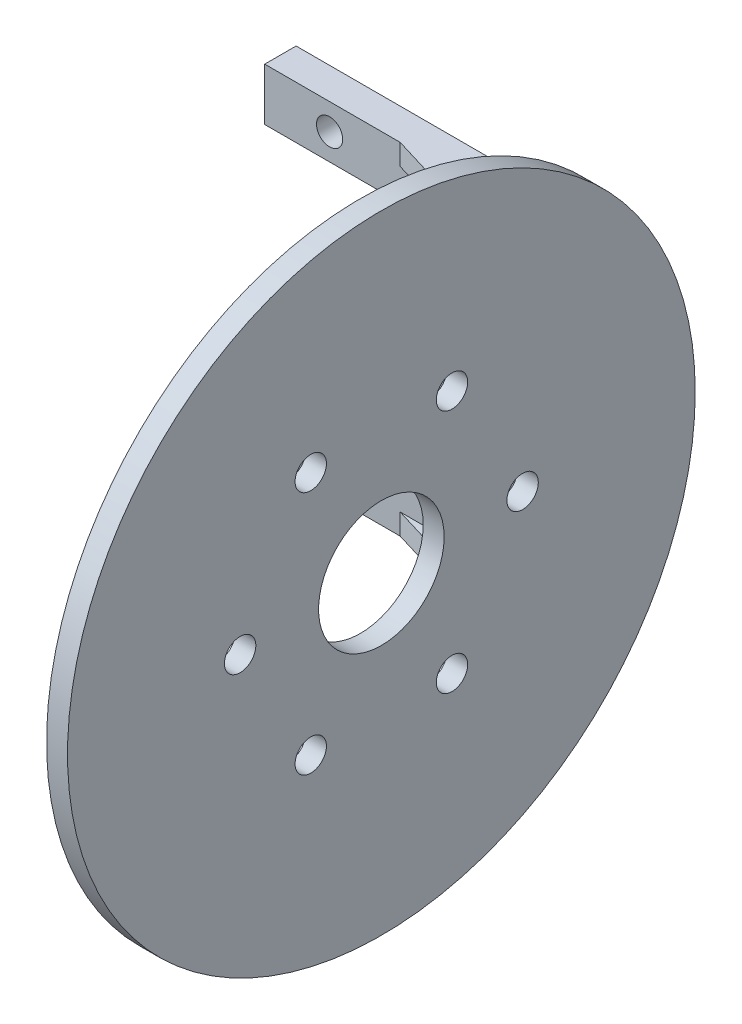
ISO-10303-21;
HEADER;
FILE_DESCRIPTION(('STEP AP214'),'2;1');
FILE_NAME('part.step','',(''),(''),'','','');
FILE_SCHEMA(('AUTOMOTIVE_DESIGN { 1 0 10303 214 1 1 1 1 }'));
ENDSEC;
DATA;
#1=APPLICATION_CONTEXT('core data for automotive mechanical design processes');
#2=APPLICATION_PROTOCOL_DEFINITION('international standard','automotive_design',2000,#1);
#3=PRODUCT_CONTEXT('',#1,'mechanical');
#4=PRODUCT('Part','Part','',(#3));
#5=PRODUCT_RELATED_PRODUCT_CATEGORY('part','',(#4));
#6=PRODUCT_DEFINITION_FORMATION('','',#4);
#7=PRODUCT_DEFINITION_CONTEXT('part definition',#1,'design');
#8=PRODUCT_DEFINITION('design','',#6,#7);
#9=PRODUCT_DEFINITION_SHAPE('','',#8);
#10=(LENGTH_UNIT() NAMED_UNIT(*) SI_UNIT(.MILLI.,.METRE.));
#11=(NAMED_UNIT(*) PLANE_ANGLE_UNIT() SI_UNIT($,.RADIAN.));
#12=(NAMED_UNIT(*) SI_UNIT($,.STERADIAN.) SOLID_ANGLE_UNIT());
#13=UNCERTAINTY_MEASURE_WITH_UNIT(LENGTH_MEASURE(1.E-05),#10,'distance_accuracy_value','');
#14=(GEOMETRIC_REPRESENTATION_CONTEXT(3) GLOBAL_UNCERTAINTY_ASSIGNED_CONTEXT((#13)) GLOBAL_UNIT_ASSIGNED_CONTEXT((#10,
#11,#12)) REPRESENTATION_CONTEXT('',''));
#15=CARTESIAN_POINT('',(0.,0.,0.));
#16=DIRECTION('',(0.,0.,1.));
#17=DIRECTION('',(1.,0.,0.));
#18=AXIS2_PLACEMENT_3D('',#15,#16,#17);
#19=CARTESIAN_POINT('',(0.,11.3,3.));
#20=DIRECTION('',(0.,1.,0.));
#21=DIRECTION('',(0.,0.,1.));
#22=AXIS2_PLACEMENT_3D('',#19,#20,#21);
#23=PLANE('',#22);
#24=DIRECTION('',(1.,0.,0.));
#25=VECTOR('',#24,1.);
#26=CARTESIAN_POINT('',(0.,11.3,0.));
#27=LINE('',#26,#25);
#28=CARTESIAN_POINT('',(-6.2,11.3,0.));
#29=VERTEX_POINT('',#28);
#30=CARTESIAN_POINT('',(6.2,11.3,0.));
#31=VERTEX_POINT('',#30);
#32=EDGE_CURVE('E236',#29,#31,#27,.T.);
#33=ORIENTED_EDGE('',*,*,#32,.T.);
#34=DIRECTION('',(0.,0.,-1.));
#35=VECTOR('',#34,1.);
#36=CARTESIAN_POINT('',(6.2,11.3,3.));
#37=LINE('',#36,#35);
#38=CARTESIAN_POINT('',(6.2,11.3,3.));
#39=VERTEX_POINT('',#38);
#40=EDGE_CURVE('E249',#39,#31,#37,.T.);
#41=ORIENTED_EDGE('',*,*,#40,.F.);
#42=DIRECTION('',(1.,0.,0.));
#43=VECTOR('',#42,1.);
#44=CARTESIAN_POINT('',(0.,11.3,3.));
#45=LINE('',#44,#43);
#46=CARTESIAN_POINT('',(-6.2,11.3,3.));
#47=VERTEX_POINT('',#46);
#48=EDGE_CURVE('E224',#47,#39,#45,.T.);
#49=ORIENTED_EDGE('',*,*,#48,.F.);
#50=DIRECTION('',(0.,0.,-1.));
#51=VECTOR('',#50,1.);
#52=CARTESIAN_POINT('',(-6.2,11.3,3.));
#53=LINE('',#52,#51);
#54=EDGE_CURVE('E233',#47,#29,#53,.T.);
#55=ORIENTED_EDGE('',*,*,#54,.T.);
#56=EDGE_LOOP('',(#33,#41,#49,#55));
#57=FACE_BOUND('',#56,.T.);
#58=ADVANCED_FACE('F36',(#57),#23,.F.);
#59=CARTESIAN_POINT('',(6.2,0.,3.));
#60=DIRECTION('',(1.,0.,0.));
#61=DIRECTION('',(0.,1.,0.));
#62=AXIS2_PLACEMENT_3D('',#59,#60,#61);
#63=PLANE('',#62);
#64=DIRECTION('',(0.,-1.,0.));
#65=VECTOR('',#64,1.);
#66=CARTESIAN_POINT('',(6.2,0.,0.));
#67=LINE('',#66,#65);
#68=CARTESIAN_POINT('',(6.2,-11.3,0.));
#69=VERTEX_POINT('',#68);
#70=EDGE_CURVE('E239',#31,#69,#67,.T.);
#71=ORIENTED_EDGE('',*,*,#70,.T.);
#72=DIRECTION('',(0.,0.,-1.));
#73=VECTOR('',#72,1.);
#74=CARTESIAN_POINT('',(6.2,-11.3,3.));
#75=LINE('',#74,#73);
#76=CARTESIAN_POINT('',(6.2,-11.3,3.));
#77=VERTEX_POINT('',#76);
#78=EDGE_CURVE('E193',#77,#69,#75,.T.);
#79=ORIENTED_EDGE('',*,*,#78,.F.);
#80=DIRECTION('',(0.,-1.,0.));
#81=VECTOR('',#80,1.);
#82=CARTESIAN_POINT('',(6.2,0.,3.));
#83=LINE('',#82,#81);
#84=EDGE_CURVE('E185',#39,#77,#83,.T.);
#85=ORIENTED_EDGE('',*,*,#84,.F.);
#86=ORIENTED_EDGE('',*,*,#40,.T.);
#87=EDGE_LOOP('',(#71,#79,#85,#86));
#88=FACE_BOUND('',#87,.T.);
#89=ADVANCED_FACE('F375',(#88),#63,.F.);
#90=CARTESIAN_POINT('',(0.,16.3,3.));
#91=DIRECTION('',(0.,1.,0.));
#92=DIRECTION('',(0.,0.,1.));
#93=AXIS2_PLACEMENT_3D('',#90,#91,#92);
#94=PLANE('',#93);
#95=DIRECTION('',(-0.956779476659756,0.,-0.29081443059567));
#96=VECTOR('',#95,1.);
#97=CARTESIAN_POINT('',(-0.263867863093174,16.3,0.868125269576544));
#98=LINE('',#97,#96);
#99=CARTESIAN_POINT('',(21.2,16.3,7.39209726443769));
#100=VERTEX_POINT('',#99);
#101=CARTESIAN_POINT('',(6.75,16.3,3.));
#102=VERTEX_POINT('',#101);
#103=EDGE_CURVE('E174',#100,#102,#98,.T.);
#104=ORIENTED_EDGE('',*,*,#103,.F.);
#105=DIRECTION('',(0.,0.,1.));
#106=VECTOR('',#105,1.);
#107=CARTESIAN_POINT('',(21.2,16.3,3.));
#108=LINE('',#107,#106);
#109=CARTESIAN_POINT('',(21.2,16.3,0.));
#110=VERTEX_POINT('',#109);
#111=EDGE_CURVE('E272',#100,#110,#108,.F.);
#112=ORIENTED_EDGE('',*,*,#111,.T.);
#113=DIRECTION('',(1.,0.,0.));
#114=VECTOR('',#113,1.);
#115=CARTESIAN_POINT('',(0.,16.3,0.));
#116=LINE('',#115,#114);
#117=CARTESIAN_POINT('',(-6.2,16.3,0.));
#118=VERTEX_POINT('',#117);
#119=EDGE_CURVE('E241',#118,#110,#116,.T.);
#120=ORIENTED_EDGE('',*,*,#119,.F.);
#121=DIRECTION('',(0.,0.,-1.));
#122=VECTOR('',#121,1.);
#123=CARTESIAN_POINT('',(-6.2,16.3,3.));
#124=LINE('',#123,#122);
#125=CARTESIAN_POINT('',(-6.2,16.3,3.));
#126=VERTEX_POINT('',#125);
#127=EDGE_CURVE('E247',#126,#118,#124,.T.);
#128=ORIENTED_EDGE('',*,*,#127,.F.);
#129=DIRECTION('',(1.,0.,0.));
#130=VECTOR('',#129,1.);
#131=CARTESIAN_POINT('',(0.,16.3,3.));
#132=LINE('',#131,#130);
#133=EDGE_CURVE('E228',#126,#102,#132,.T.);
#134=ORIENTED_EDGE('',*,*,#133,.T.);
#135=EDGE_LOOP('',(#104,#112,#120,#128,#134));
#136=FACE_BOUND('',#135,.T.);
#137=ADVANCED_FACE('F381',(#136),#94,.T.);
#138=CARTESIAN_POINT('',(0.,13.8,3.));
#139=DIRECTION('',(0.,0.,-1.));
#140=DIRECTION('',(-1.,0.,0.));
#141=AXIS2_PLACEMENT_3D('',#138,#139,#140);
#142=CYLINDRICAL_SURFACE('',#141,1.25);
#143=CARTESIAN_POINT('',(0.,13.8,3.));
#144=DIRECTION('',(0.,0.,1.));
#145=DIRECTION('',(1.,0.,0.));
#146=AXIS2_PLACEMENT_3D('',#143,#144,#145);
#147=CIRCLE('',#146,1.25);
#148=CARTESIAN_POINT('',(1.25,13.8,3.));
#149=VERTEX_POINT('',#148);
#150=EDGE_CURVE('E221',#149,#149,#147,.T.);
#151=ORIENTED_EDGE('',*,*,#150,.T.);
#152=EDGE_LOOP('',(#151));
#153=FACE_BOUND('',#152,.T.);
#154=CARTESIAN_POINT('',(0.,13.8,0.));
#155=DIRECTION('',(0.,0.,1.));
#156=DIRECTION('',(1.,0.,0.));
#157=AXIS2_PLACEMENT_3D('',#154,#155,#156);
#158=CIRCLE('',#157,1.25);
#159=CARTESIAN_POINT('',(1.25,13.8,0.));
#160=VERTEX_POINT('',#159);
#161=EDGE_CURVE('E220',#160,#160,#158,.T.);
#162=ORIENTED_EDGE('',*,*,#161,.F.);
#163=EDGE_LOOP('',(#162));
#164=FACE_BOUND('',#163,.T.);
#165=ADVANCED_FACE('F386',(#153,#164),#142,.F.);
#166=CARTESIAN_POINT('',(-6.19999999999999,0.,3.));
#167=DIRECTION('',(1.,0.,0.));
#168=DIRECTION('',(0.,1.,0.));
#169=AXIS2_PLACEMENT_3D('',#166,#167,#168);
#170=PLANE('',#169);
#171=DIRECTION('',(0.,-1.,0.));
#172=VECTOR('',#171,1.);
#173=CARTESIAN_POINT('',(-6.19999999999999,0.,0.));
#174=LINE('',#173,#172);
#175=EDGE_CURVE('E225',#118,#29,#174,.T.);
#176=ORIENTED_EDGE('',*,*,#175,.T.);
#177=ORIENTED_EDGE('',*,*,#54,.F.);
#178=DIRECTION('',(0.,-1.,0.));
#179=VECTOR('',#178,1.);
#180=CARTESIAN_POINT('',(-6.19999999999999,0.,3.));
#181=LINE('',#180,#179);
#182=EDGE_CURVE('E231',#126,#47,#181,.T.);
#183=ORIENTED_EDGE('',*,*,#182,.F.);
#184=ORIENTED_EDGE('',*,*,#127,.T.);
#185=EDGE_LOOP('',(#176,#177,#183,#184));
#186=FACE_BOUND('',#185,.T.);
#187=ADVANCED_FACE('F370',(#186),#170,.F.);
#188=CARTESIAN_POINT('',(0.,0.,3.));
#189=DIRECTION('',(0.,0.,1.));
#190=DIRECTION('',(1.,0.,0.));
#191=AXIS2_PLACEMENT_3D('',#188,#189,#190);
#192=PLANE('',#191);
#193=DIRECTION('',(1.,0.,0.));
#194=VECTOR('',#193,1.);
#195=CARTESIAN_POINT('',(0.,-14.3,3.));
#196=LINE('',#195,#194);
#197=CARTESIAN_POINT('',(6.75,-14.3,3.));
#198=VERTEX_POINT('',#197);
#199=CARTESIAN_POINT('',(21.2,-14.3,3.));
#200=VERTEX_POINT('',#199);
#201=EDGE_CURVE('E342',#198,#200,#196,.T.);
#202=ORIENTED_EDGE('',*,*,#201,.T.);
#203=DIRECTION('',(0.,-1.,0.));
#204=VECTOR('',#203,1.);
#205=CARTESIAN_POINT('',(21.2,0.,3.));
#206=LINE('',#205,#204);
#207=CARTESIAN_POINT('',(21.2,14.3,3.));
#208=VERTEX_POINT('',#207);
#209=EDGE_CURVE('E278',#200,#208,#206,.F.);
#210=ORIENTED_EDGE('',*,*,#209,.T.);
#211=DIRECTION('',(1.,0.,0.));
#212=VECTOR('',#211,1.);
#213=CARTESIAN_POINT('',(0.,14.3,3.));
#214=LINE('',#213,#212);
#215=CARTESIAN_POINT('',(6.75,14.3,3.));
#216=VERTEX_POINT('',#215);
#217=EDGE_CURVE('E211',#216,#208,#214,.T.);
#218=ORIENTED_EDGE('',*,*,#217,.F.);
#219=DIRECTION('',(0.,1.,0.));
#220=VECTOR('',#219,1.);
#221=CARTESIAN_POINT('',(6.75,14.3,3.));
#222=LINE('',#221,#220);
#223=EDGE_CURVE('E214',#216,#102,#222,.T.);
#224=ORIENTED_EDGE('',*,*,#223,.T.);
#225=ORIENTED_EDGE('',*,*,#133,.F.);
#226=ORIENTED_EDGE('',*,*,#182,.T.);
#227=ORIENTED_EDGE('',*,*,#48,.T.);
#228=ORIENTED_EDGE('',*,*,#84,.T.);
#229=DIRECTION('',(1.,0.,0.));
#230=VECTOR('',#229,1.);
#231=CARTESIAN_POINT('',(0.,-11.3,3.));
#232=LINE('',#231,#230);
#233=CARTESIAN_POINT('',(-6.2,-11.3,3.));
#234=VERTEX_POINT('',#233);
#235=EDGE_CURVE('E167',#234,#77,#232,.T.);
#236=ORIENTED_EDGE('',*,*,#235,.F.);
#237=DIRECTION('',(0.,1.,0.));
#238=VECTOR('',#237,1.);
#239=CARTESIAN_POINT('',(-6.19999999999999,0.,3.));
#240=LINE('',#239,#238);
#241=CARTESIAN_POINT('',(-6.2,-16.3,3.));
#242=VERTEX_POINT('',#241);
#243=EDGE_CURVE('E183',#242,#234,#240,.T.);
#244=ORIENTED_EDGE('',*,*,#243,.F.);
#245=DIRECTION('',(1.,0.,0.));
#246=VECTOR('',#245,1.);
#247=CARTESIAN_POINT('',(0.,-16.3,3.));
#248=LINE('',#247,#246);
#249=CARTESIAN_POINT('',(6.75,-16.3,3.));
#250=VERTEX_POINT('',#249);
#251=EDGE_CURVE('E191',#242,#250,#248,.T.);
#252=ORIENTED_EDGE('',*,*,#251,.T.);
#253=DIRECTION('',(0.,-1.,0.));
#254=VECTOR('',#253,1.);
#255=CARTESIAN_POINT('',(6.75,-14.3,3.));
#256=LINE('',#255,#254);
#257=EDGE_CURVE('E200',#198,#250,#256,.T.);
#258=ORIENTED_EDGE('',*,*,#257,.F.);
#259=EDGE_LOOP('',(#202,#210,#218,#224,#225,#226,#227,#228,#236,#244,#252,#258));
#260=FACE_BOUND('',#259,.T.);
#261=ORIENTED_EDGE('',*,*,#150,.F.);
#262=EDGE_LOOP('',(#261));
#263=FACE_BOUND('',#262,.T.);
#264=CARTESIAN_POINT('',(0.,-13.8,3.));
#265=DIRECTION('',(0.,0.,-1.));
#266=DIRECTION('',(1.,0.,0.));
#267=AXIS2_PLACEMENT_3D('',#264,#265,#266);
#268=CIRCLE('',#267,1.25);
#269=CARTESIAN_POINT('',(1.25,-13.8,3.));
#270=VERTEX_POINT('',#269);
#271=EDGE_CURVE('E187',#270,#270,#268,.T.);
#272=ORIENTED_EDGE('',*,*,#271,.T.);
#273=EDGE_LOOP('',(#272));
#274=FACE_BOUND('',#273,.T.);
#275=ADVANCED_FACE('F180',(#260,#263,#274),#192,.T.);
#276=CARTESIAN_POINT('',(0.,0.,0.));
#277=DIRECTION('',(0.,0.,1.));
#278=DIRECTION('',(1.,0.,0.));
#279=AXIS2_PLACEMENT_3D('',#276,#277,#278);
#280=PLANE('',#279);
#281=ORIENTED_EDGE('',*,*,#161,.T.);
#282=EDGE_LOOP('',(#281));
#283=FACE_BOUND('',#282,.T.);
#284=ORIENTED_EDGE('',*,*,#32,.F.);
#285=ORIENTED_EDGE('',*,*,#175,.F.);
#286=ORIENTED_EDGE('',*,*,#119,.T.);
#287=CARTESIAN_POINT('',(21.2,18.3,0.));
#288=DIRECTION('',(0.,0.,1.));
#289=DIRECTION('',(1.,0.,0.));
#290=AXIS2_PLACEMENT_3D('',#287,#288,#289);
#291=CIRCLE('',#290,2.);
#292=CARTESIAN_POINT('',(23.2,18.3,0.));
#293=VERTEX_POINT('',#292);
#294=EDGE_CURVE('E286',#110,#293,#291,.T.);
#295=ORIENTED_EDGE('',*,*,#294,.T.);
#296=DIRECTION('',(0.,1.,0.));
#297=VECTOR('',#296,1.);
#298=CARTESIAN_POINT('',(23.2,0.,0.));
#299=LINE('',#298,#297);
#300=CARTESIAN_POINT('',(23.2,-18.3,0.));
#301=VERTEX_POINT('',#300);
#302=EDGE_CURVE('E218',#301,#293,#299,.T.);
#303=ORIENTED_EDGE('',*,*,#302,.F.);
#304=CARTESIAN_POINT('',(21.2,-18.3,0.));
#305=DIRECTION('',(0.,0.,1.));
#306=DIRECTION('',(1.,0.,0.));
#307=AXIS2_PLACEMENT_3D('',#304,#305,#306);
#308=CIRCLE('',#307,2.);
#309=CARTESIAN_POINT('',(21.2,-16.3,0.));
#310=VERTEX_POINT('',#309);
#311=EDGE_CURVE('E11',#301,#310,#308,.T.);
#312=ORIENTED_EDGE('',*,*,#311,.T.);
#313=DIRECTION('',(1.,0.,0.));
#314=VECTOR('',#313,1.);
#315=CARTESIAN_POINT('',(0.,-16.3,0.));
#316=LINE('',#315,#314);
#317=CARTESIAN_POINT('',(-6.2,-16.3,0.));
#318=VERTEX_POINT('',#317);
#319=EDGE_CURVE('E204',#318,#310,#316,.T.);
#320=ORIENTED_EDGE('',*,*,#319,.F.);
#321=DIRECTION('',(0.,1.,0.));
#322=VECTOR('',#321,1.);
#323=CARTESIAN_POINT('',(-6.19999999999999,0.,0.));
#324=LINE('',#323,#322);
#325=CARTESIAN_POINT('',(-6.2,-11.3,0.));
#326=VERTEX_POINT('',#325);
#327=EDGE_CURVE('E202',#318,#326,#324,.T.);
#328=ORIENTED_EDGE('',*,*,#327,.T.);
#329=DIRECTION('',(1.,0.,0.));
#330=VECTOR('',#329,1.);
#331=CARTESIAN_POINT('',(0.,-11.3,0.));
#332=LINE('',#331,#330);
#333=EDGE_CURVE('E169',#326,#69,#332,.T.);
#334=ORIENTED_EDGE('',*,*,#333,.T.);
#335=ORIENTED_EDGE('',*,*,#70,.F.);
#336=EDGE_LOOP('',(#284,#285,#286,#295,#303,#312,#320,#328,#334,#335));
#337=FACE_BOUND('',#336,.T.);
#338=CARTESIAN_POINT('',(0.,-13.8,0.));
#339=DIRECTION('',(0.,0.,-1.));
#340=DIRECTION('',(1.,0.,0.));
#341=AXIS2_PLACEMENT_3D('',#338,#339,#340);
#342=CIRCLE('',#341,1.25);
#343=CARTESIAN_POINT('',(1.25,-13.8,0.));
#344=VERTEX_POINT('',#343);
#345=EDGE_CURVE('E197',#344,#344,#342,.T.);
#346=ORIENTED_EDGE('',*,*,#345,.F.);
#347=EDGE_LOOP('',(#346));
#348=FACE_BOUND('',#347,.T.);
#349=ADVANCED_FACE('F359',(#283,#337,#348),#280,.F.);
#350=CARTESIAN_POINT('',(-0.263867863093174,14.3,0.868125269576544));
#351=DIRECTION('',(0.29081443059567,0.,-0.956779476659756));
#352=DIRECTION('',(-0.956779476659756,0.,-0.29081443059567));
#353=AXIS2_PLACEMENT_3D('',#350,#351,#352);
#354=PLANE('',#353);
#355=CARTESIAN_POINT('',(21.2,12.3,7.39209726443769));
#356=DIRECTION('',(0.29081443059567,0.,-0.956779476659756));
#357=DIRECTION('',(-0.956779476659756,0.,-0.29081443059567));
#358=AXIS2_PLACEMENT_3D('',#355,#356,#357);
#359=ELLIPSE('',#358,2.09034584121961,2.);
#360=CARTESIAN_POINT('',(21.2,14.3,7.39209726443769));
#361=VERTEX_POINT('',#360);
#362=CARTESIAN_POINT('',(21.7816288611913,14.2135589533195,7.56888415233779));
#363=VERTEX_POINT('',#362);
#364=EDGE_CURVE('E282',#361,#363,#359,.T.);
#365=ORIENTED_EDGE('',*,*,#364,.T.);
#366=DIRECTION('',(0.,1.,0.));
#367=VECTOR('',#366,1.);
#368=CARTESIAN_POINT('',(21.7816288611913,16.3,7.56888415233779));
#369=LINE('',#368,#367);
#370=CARTESIAN_POINT('',(21.7816288611913,16.3864410466805,7.56888415233779));
#371=VERTEX_POINT('',#370);
#372=EDGE_CURVE('E61',#363,#371,#369,.T.);
#373=ORIENTED_EDGE('',*,*,#372,.T.);
#374=CARTESIAN_POINT('',(21.2,18.3,7.39209726443769));
#375=DIRECTION('',(0.29081443059567,0.,-0.956779476659756));
#376=DIRECTION('',(0.956779476659756,0.,0.29081443059567));
#377=AXIS2_PLACEMENT_3D('',#374,#375,#376);
#378=ELLIPSE('',#377,2.09034584121961,2.);
#379=EDGE_CURVE('E284',#371,#100,#378,.T.);
#380=ORIENTED_EDGE('',*,*,#379,.T.);
#381=ORIENTED_EDGE('',*,*,#103,.T.);
#382=ORIENTED_EDGE('',*,*,#223,.F.);
#383=DIRECTION('',(-0.956779476659756,0.,-0.29081443059567));
#384=VECTOR('',#383,1.);
#385=CARTESIAN_POINT('',(-0.263867863093174,14.3,0.868125269576544));
#386=LINE('',#385,#384);
#387=EDGE_CURVE('E209',#361,#216,#386,.T.);
#388=ORIENTED_EDGE('',*,*,#387,.F.);
#389=EDGE_LOOP('',(#365,#373,#380,#381,#382,#388));
#390=FACE_BOUND('',#389,.T.);
#391=ADVANCED_FACE('F361',(#390),#354,.F.);
#392=CARTESIAN_POINT('',(0.,14.3,0.));
#393=DIRECTION('',(0.,1.,0.));
#394=DIRECTION('',(0.,0.,1.));
#395=AXIS2_PLACEMENT_3D('',#392,#393,#394);
#396=PLANE('',#395);
#397=ORIENTED_EDGE('',*,*,#217,.T.);
#398=DIRECTION('',(0.,0.,1.));
#399=VECTOR('',#398,1.);
#400=CARTESIAN_POINT('',(21.2,14.3,8.));
#401=LINE('',#400,#399);
#402=EDGE_CURVE('E270',#208,#361,#401,.T.);
#403=ORIENTED_EDGE('',*,*,#402,.T.);
#404=ORIENTED_EDGE('',*,*,#387,.T.);
#405=EDGE_LOOP('',(#397,#403,#404));
#406=FACE_BOUND('',#405,.T.);
#407=ADVANCED_FACE('F368',(#406),#396,.F.);
#408=CARTESIAN_POINT('',(0.,-11.3,3.));
#409=DIRECTION('',(0.,1.,0.));
#410=DIRECTION('',(-1.,0.,0.));
#411=AXIS2_PLACEMENT_3D('',#408,#409,#410);
#412=PLANE('',#411);
#413=ORIENTED_EDGE('',*,*,#333,.F.);
#414=DIRECTION('',(0.,0.,-1.));
#415=VECTOR('',#414,1.);
#416=CARTESIAN_POINT('',(-6.2,-11.3,3.));
#417=LINE('',#416,#415);
#418=EDGE_CURVE('E163',#234,#326,#417,.T.);
#419=ORIENTED_EDGE('',*,*,#418,.F.);
#420=ORIENTED_EDGE('',*,*,#235,.T.);
#421=ORIENTED_EDGE('',*,*,#78,.T.);
#422=EDGE_LOOP('',(#413,#419,#420,#421));
#423=FACE_BOUND('',#422,.T.);
#424=ADVANCED_FACE('F165',(#423),#412,.T.);
#425=CARTESIAN_POINT('',(-6.19999999999999,0.,3.));
#426=DIRECTION('',(-1.,0.,0.));
#427=DIRECTION('',(0.,-1.,0.));
#428=AXIS2_PLACEMENT_3D('',#425,#426,#427);
#429=PLANE('',#428);
#430=ORIENTED_EDGE('',*,*,#327,.F.);
#431=DIRECTION('',(0.,0.,-1.));
#432=VECTOR('',#431,1.);
#433=CARTESIAN_POINT('',(-6.2,-16.3,3.));
#434=LINE('',#433,#432);
#435=EDGE_CURVE('E175',#242,#318,#434,.T.);
#436=ORIENTED_EDGE('',*,*,#435,.F.);
#437=ORIENTED_EDGE('',*,*,#243,.T.);
#438=ORIENTED_EDGE('',*,*,#418,.T.);
#439=EDGE_LOOP('',(#430,#436,#437,#438));
#440=FACE_BOUND('',#439,.T.);
#441=ADVANCED_FACE('F189',(#440),#429,.T.);
#442=CARTESIAN_POINT('',(0.,-16.3,3.));
#443=DIRECTION('',(0.,1.,0.));
#444=DIRECTION('',(-1.,0.,0.));
#445=AXIS2_PLACEMENT_3D('',#442,#443,#444);
#446=PLANE('',#445);
#447=ORIENTED_EDGE('',*,*,#319,.T.);
#448=DIRECTION('',(0.,0.,1.));
#449=VECTOR('',#448,1.);
#450=CARTESIAN_POINT('',(21.2,-16.3,8.));
#451=LINE('',#450,#449);
#452=CARTESIAN_POINT('',(21.2,-16.3,7.39209726443769));
#453=VERTEX_POINT('',#452);
#454=EDGE_CURVE('E274',#310,#453,#451,.T.);
#455=ORIENTED_EDGE('',*,*,#454,.T.);
#456=DIRECTION('',(-0.956779476659756,0.,-0.29081443059567));
#457=VECTOR('',#456,1.);
#458=CARTESIAN_POINT('',(-0.26386786309317,-16.3,0.868125269576544));
#459=LINE('',#458,#457);
#460=EDGE_CURVE('E343',#453,#250,#459,.T.);
#461=ORIENTED_EDGE('',*,*,#460,.T.);
#462=ORIENTED_EDGE('',*,*,#251,.F.);
#463=ORIENTED_EDGE('',*,*,#435,.T.);
#464=EDGE_LOOP('',(#447,#455,#461,#462,#463));
#465=FACE_BOUND('',#464,.T.);
#466=ADVANCED_FACE('F355',(#465),#446,.F.);
#467=CARTESIAN_POINT('',(0.,-13.8,3.));
#468=DIRECTION('',(0.,0.,-1.));
#469=DIRECTION('',(-1.,0.,0.));
#470=AXIS2_PLACEMENT_3D('',#467,#468,#469);
#471=CYLINDRICAL_SURFACE('',#470,1.25);
#472=ORIENTED_EDGE('',*,*,#271,.F.);
#473=EDGE_LOOP('',(#472));
#474=FACE_BOUND('',#473,.T.);
#475=ORIENTED_EDGE('',*,*,#345,.T.);
#476=EDGE_LOOP('',(#475));
#477=FACE_BOUND('',#476,.T.);
#478=ADVANCED_FACE('F351',(#474,#477),#471,.F.);
#479=CARTESIAN_POINT('',(-0.263867863093171,-14.3,0.868125269576544));
#480=DIRECTION('',(-0.29081443059567,0.,0.956779476659756));
#481=DIRECTION('',(0.956779476659756,0.,0.29081443059567));
#482=AXIS2_PLACEMENT_3D('',#479,#480,#481);
#483=PLANE('',#482);
#484=CARTESIAN_POINT('',(21.2,-18.3,7.39209726443769));
#485=DIRECTION('',(-0.29081443059567,0.,0.956779476659756));
#486=DIRECTION('',(-0.956779476659756,0.,-0.29081443059567));
#487=AXIS2_PLACEMENT_3D('',#484,#485,#486);
#488=ELLIPSE('',#487,2.09034584121961,2.);
#489=CARTESIAN_POINT('',(21.7816288611913,-16.3864410466805,7.56888415233779));
#490=VERTEX_POINT('',#489);
#491=EDGE_CURVE('E45',#453,#490,#488,.F.);
#492=ORIENTED_EDGE('',*,*,#491,.T.);
#493=DIRECTION('',(0.,-1.,0.));
#494=VECTOR('',#493,1.);
#495=CARTESIAN_POINT('',(21.7816288611913,-14.3,7.56888415233779));
#496=LINE('',#495,#494);
#497=CARTESIAN_POINT('',(21.7816288611913,-14.2135589533195,7.56888415233779));
#498=VERTEX_POINT('',#497);
#499=EDGE_CURVE('E53',#490,#498,#496,.F.);
#500=ORIENTED_EDGE('',*,*,#499,.T.);
#501=CARTESIAN_POINT('',(21.2,-12.3,7.39209726443769));
#502=DIRECTION('',(-0.29081443059567,0.,0.956779476659756));
#503=DIRECTION('',(-0.956779476659756,0.,-0.29081443059567));
#504=AXIS2_PLACEMENT_3D('',#501,#502,#503);
#505=ELLIPSE('',#504,2.09034584121961,2.);
#506=CARTESIAN_POINT('',(21.2,-14.3,7.39209726443769));
#507=VERTEX_POINT('',#506);
#508=EDGE_CURVE('E280',#498,#507,#505,.F.);
#509=ORIENTED_EDGE('',*,*,#508,.T.);
#510=DIRECTION('',(-0.956779476659756,0.,-0.29081443059567));
#511=VECTOR('',#510,1.);
#512=CARTESIAN_POINT('',(-0.263867863093171,-14.3,0.868125269576544));
#513=LINE('',#512,#511);
#514=EDGE_CURVE('E340',#507,#198,#513,.T.);
#515=ORIENTED_EDGE('',*,*,#514,.T.);
#516=ORIENTED_EDGE('',*,*,#257,.T.);
#517=ORIENTED_EDGE('',*,*,#460,.F.);
#518=EDGE_LOOP('',(#492,#500,#509,#515,#516,#517));
#519=FACE_BOUND('',#518,.T.);
#520=ADVANCED_FACE('F354',(#519),#483,.T.);
#521=CARTESIAN_POINT('',(0.,-14.3,0.));
#522=DIRECTION('',(0.,-1.,0.));
#523=DIRECTION('',(0.,0.,1.));
#524=AXIS2_PLACEMENT_3D('',#521,#522,#523);
#525=PLANE('',#524);
#526=ORIENTED_EDGE('',*,*,#514,.F.);
#527=DIRECTION('',(0.,0.,1.));
#528=VECTOR('',#527,1.);
#529=CARTESIAN_POINT('',(21.2,-14.3,3.));
#530=LINE('',#529,#528);
#531=EDGE_CURVE('E268',#507,#200,#530,.F.);
#532=ORIENTED_EDGE('',*,*,#531,.T.);
#533=ORIENTED_EDGE('',*,*,#201,.F.);
#534=EDGE_LOOP('',(#526,#532,#533));
#535=FACE_BOUND('',#534,.T.);
#536=ADVANCED_FACE('F449',(#535),#525,.F.);
#537=CARTESIAN_POINT('',(23.2,0.,0.));
#538=DIRECTION('',(1.,0.,0.));
#539=DIRECTION('',(0.,0.,-1.));
#540=AXIS2_PLACEMENT_3D('',#537,#538,#539);
#541=PLANE('',#540);
#542=ORIENTED_EDGE('',*,*,#302,.T.);
#543=DIRECTION('',(0.,0.,1.));
#544=VECTOR('',#543,1.);
#545=CARTESIAN_POINT('',(23.2,18.3,0.));
#546=LINE('',#545,#544);
#547=CARTESIAN_POINT('',(23.2,18.3,9.48244310565731));
#548=VERTEX_POINT('',#547);
#549=EDGE_CURVE('E266',#293,#548,#546,.T.);
#550=ORIENTED_EDGE('',*,*,#549,.T.);
#551=DIRECTION('',(0.,1.,0.));
#552=VECTOR('',#551,1.);
#553=CARTESIAN_POINT('',(23.2,14.3,9.48244310565731));
#554=LINE('',#553,#552);
#555=CARTESIAN_POINT('',(23.2,12.3,9.48244310565731));
#556=VERTEX_POINT('',#555);
#557=EDGE_CURVE('E259',#548,#556,#554,.F.);
#558=ORIENTED_EDGE('',*,*,#557,.T.);
#559=DIRECTION('',(0.,0.,1.));
#560=VECTOR('',#559,1.);
#561=CARTESIAN_POINT('',(23.2,12.3,3.));
#562=LINE('',#561,#560);
#563=CARTESIAN_POINT('',(23.2,12.3,5.));
#564=VERTEX_POINT('',#563);
#565=EDGE_CURVE('E254',#556,#564,#562,.F.);
#566=ORIENTED_EDGE('',*,*,#565,.T.);
#567=DIRECTION('',(0.,-1.,0.));
#568=VECTOR('',#567,1.);
#569=CARTESIAN_POINT('',(23.2,0.,5.));
#570=LINE('',#569,#568);
#571=CARTESIAN_POINT('',(23.2,-12.3,5.));
#572=VERTEX_POINT('',#571);
#573=EDGE_CURVE('E252',#564,#572,#570,.T.);
#574=ORIENTED_EDGE('',*,*,#573,.T.);
#575=DIRECTION('',(0.,0.,1.));
#576=VECTOR('',#575,1.);
#577=CARTESIAN_POINT('',(23.2,-12.3,8.));
#578=LINE('',#577,#576);
#579=CARTESIAN_POINT('',(23.2,-12.3,9.48244310565731));
#580=VERTEX_POINT('',#579);
#581=EDGE_CURVE('E256',#572,#580,#578,.T.);
#582=ORIENTED_EDGE('',*,*,#581,.T.);
#583=DIRECTION('',(0.,-1.,0.));
#584=VECTOR('',#583,1.);
#585=CARTESIAN_POINT('',(23.2,0.,9.48244310565731));
#586=LINE('',#585,#584);
#587=CARTESIAN_POINT('',(23.2,-18.3,9.48244310565731));
#588=VERTEX_POINT('',#587);
#589=EDGE_CURVE('E261',#580,#588,#586,.T.);
#590=ORIENTED_EDGE('',*,*,#589,.T.);
#591=DIRECTION('',(0.,0.,1.));
#592=VECTOR('',#591,1.);
#593=CARTESIAN_POINT('',(23.2,-18.3,0.));
#594=LINE('',#593,#592);
#595=EDGE_CURVE('E263',#588,#301,#594,.F.);
#596=ORIENTED_EDGE('',*,*,#595,.T.);
#597=EDGE_LOOP('',(#542,#550,#558,#566,#574,#582,#590,#596));
#598=FACE_BOUND('',#597,.T.);
#599=CARTESIAN_POINT('',(23.2,-11.6913429510896,30.0000000000002));
#600=DIRECTION('',(1.,0.,0.));
#601=DIRECTION('',(0.,0.,-1.));
#602=AXIS2_PLACEMENT_3D('',#599,#600,#601);
#603=CIRCLE('',#602,1.5);
#604=CARTESIAN_POINT('',(23.2,-11.6913429510896,28.5000000000002));
#605=VERTEX_POINT('',#604);
#606=EDGE_CURVE('E306',#605,#605,#603,.T.);
#607=ORIENTED_EDGE('',*,*,#606,.T.);
#608=EDGE_LOOP('',(#607));
#609=FACE_BOUND('',#608,.T.);
#610=CARTESIAN_POINT('',(23.2,11.6913429510902,16.5000000000001));
#611=DIRECTION('',(1.,0.,0.));
#612=DIRECTION('',(0.,0.,-1.));
#613=AXIS2_PLACEMENT_3D('',#610,#611,#612);
#614=CIRCLE('',#613,1.5);
#615=CARTESIAN_POINT('',(23.2,11.6913429510902,15.0000000000001));
#616=VERTEX_POINT('',#615);
#617=EDGE_CURVE('E311',#616,#616,#614,.T.);
#618=ORIENTED_EDGE('',*,*,#617,.T.);
#619=EDGE_LOOP('',(#618));
#620=FACE_BOUND('',#619,.T.);
#621=CARTESIAN_POINT('',(23.2,0.,9.75));
#622=DIRECTION('',(1.,0.,0.));
#623=DIRECTION('',(0.,0.,-1.));
#624=AXIS2_PLACEMENT_3D('',#621,#622,#623);
#625=CIRCLE('',#624,1.5);
#626=CARTESIAN_POINT('',(23.2,0.,8.25));
#627=VERTEX_POINT('',#626);
#628=EDGE_CURVE('E316',#627,#627,#625,.T.);
#629=ORIENTED_EDGE('',*,*,#628,.T.);
#630=EDGE_LOOP('',(#629));
#631=FACE_BOUND('',#630,.T.);
#632=CARTESIAN_POINT('',(23.2,0.,36.75));
#633=DIRECTION('',(1.,0.,0.));
#634=DIRECTION('',(0.,0.,-1.));
#635=AXIS2_PLACEMENT_3D('',#632,#633,#634);
#636=CIRCLE('',#635,1.5);
#637=CARTESIAN_POINT('',(23.2,0.,35.25));
#638=VERTEX_POINT('',#637);
#639=EDGE_CURVE('E324',#638,#638,#636,.T.);
#640=ORIENTED_EDGE('',*,*,#639,.T.);
#641=EDGE_LOOP('',(#640));
#642=FACE_BOUND('',#641,.T.);
#643=CARTESIAN_POINT('',(23.2,-11.6913429510898,16.5000000000002));
#644=DIRECTION('',(1.,0.,0.));
#645=DIRECTION('',(0.,0.,-1.));
#646=AXIS2_PLACEMENT_3D('',#643,#644,#645);
#647=CIRCLE('',#646,1.5);
#648=CARTESIAN_POINT('',(23.2,-11.6913429510898,15.0000000000002));
#649=VERTEX_POINT('',#648);
#650=EDGE_CURVE('E327',#649,#649,#647,.T.);
#651=ORIENTED_EDGE('',*,*,#650,.T.);
#652=EDGE_LOOP('',(#651));
#653=FACE_BOUND('',#652,.T.);
#654=CARTESIAN_POINT('',(23.2,11.69134295109,30.0000000000001));
#655=DIRECTION('',(1.,0.,0.));
#656=DIRECTION('',(0.,0.,-1.));
#657=AXIS2_PLACEMENT_3D('',#654,#655,#656);
#658=CIRCLE('',#657,1.5);
#659=CARTESIAN_POINT('',(23.2,11.69134295109,28.5000000000001));
#660=VERTEX_POINT('',#659);
#661=EDGE_CURVE('E330',#660,#660,#658,.T.);
#662=ORIENTED_EDGE('',*,*,#661,.T.);
#663=EDGE_LOOP('',(#662));
#664=FACE_BOUND('',#663,.T.);
#665=CARTESIAN_POINT('',(23.2,0.,23.25));
#666=DIRECTION('',(1.,0.,0.));
#667=DIRECTION('',(0.,0.,-1.));
#668=AXIS2_PLACEMENT_3D('',#665,#666,#667);
#669=CIRCLE('',#668,6.);
#670=CARTESIAN_POINT('',(23.2,0.,17.25));
#671=VERTEX_POINT('',#670);
#672=EDGE_CURVE('E333',#671,#671,#669,.T.);
#673=ORIENTED_EDGE('',*,*,#672,.T.);
#674=EDGE_LOOP('',(#673));
#675=FACE_BOUND('',#674,.T.);
#676=CARTESIAN_POINT('',(23.2,0.,23.25));
#677=DIRECTION('',(1.,0.,0.));
#678=DIRECTION('',(0.,0.,-1.));
#679=AXIS2_PLACEMENT_3D('',#676,#677,#678);
#680=CIRCLE('',#679,30.);
#681=CARTESIAN_POINT('',(23.2,0.,-6.75));
#682=VERTEX_POINT('',#681);
#683=EDGE_CURVE('E336',#682,#682,#680,.T.);
#684=ORIENTED_EDGE('',*,*,#683,.F.);
#685=EDGE_LOOP('',(#684));
#686=FACE_BOUND('',#685,.T.);
#687=ADVANCED_FACE('F424',(#598,#609,#620,#631,#642,#653,#664,#675,#686),#541,.F.);
#688=CARTESIAN_POINT('',(25.2,0.,23.25));
#689=DIRECTION('',(-1.,0.,0.));
#690=DIRECTION('',(0.,0.,1.));
#691=AXIS2_PLACEMENT_3D('',#688,#689,#690);
#692=CYLINDRICAL_SURFACE('',#691,6.);
#693=CARTESIAN_POINT('',(25.2,0.,23.25));
#694=DIRECTION('',(1.,0.,0.));
#695=DIRECTION('',(0.,0.,-1.));
#696=AXIS2_PLACEMENT_3D('',#693,#694,#695);
#697=CIRCLE('',#696,6.);
#698=CARTESIAN_POINT('',(25.2,0.,17.25));
#699=VERTEX_POINT('',#698);
#700=EDGE_CURVE('E518',#699,#699,#697,.T.);
#701=ORIENTED_EDGE('',*,*,#700,.T.);
#702=EDGE_LOOP('',(#701));
#703=FACE_BOUND('',#702,.T.);
#704=ORIENTED_EDGE('',*,*,#672,.F.);
#705=EDGE_LOOP('',(#704));
#706=FACE_BOUND('',#705,.T.);
#707=ADVANCED_FACE('F478',(#703,#706),#692,.F.);
#708=CARTESIAN_POINT('',(25.2,11.69134295109,30.0000000000001));
#709=DIRECTION('',(-1.,0.,0.));
#710=DIRECTION('',(0.,0.,1.));
#711=AXIS2_PLACEMENT_3D('',#708,#709,#710);
#712=CYLINDRICAL_SURFACE('',#711,1.5);
#713=CARTESIAN_POINT('',(25.2,11.69134295109,30.0000000000001));
#714=DIRECTION('',(1.,0.,0.));
#715=DIRECTION('',(0.,0.,-1.));
#716=AXIS2_PLACEMENT_3D('',#713,#714,#715);
#717=CIRCLE('',#716,1.5);
#718=CARTESIAN_POINT('',(25.2,11.69134295109,28.5000000000001));
#719=VERTEX_POINT('',#718);
#720=EDGE_CURVE('E514',#719,#719,#717,.T.);
#721=ORIENTED_EDGE('',*,*,#720,.T.);
#722=EDGE_LOOP('',(#721));
#723=FACE_BOUND('',#722,.T.);
#724=ORIENTED_EDGE('',*,*,#661,.F.);
#725=EDGE_LOOP('',(#724));
#726=FACE_BOUND('',#725,.T.);
#727=ADVANCED_FACE('F474',(#723,#726),#712,.F.);
#728=CARTESIAN_POINT('',(25.2,-11.6913429510898,16.5000000000002));
#729=DIRECTION('',(-1.,0.,0.));
#730=DIRECTION('',(0.,0.,1.));
#731=AXIS2_PLACEMENT_3D('',#728,#729,#730);
#732=CYLINDRICAL_SURFACE('',#731,1.5);
#733=CARTESIAN_POINT('',(25.2,-11.6913429510898,16.5000000000002));
#734=DIRECTION('',(1.,0.,0.));
#735=DIRECTION('',(0.,0.,-1.));
#736=AXIS2_PLACEMENT_3D('',#733,#734,#735);
#737=CIRCLE('',#736,1.5);
#738=CARTESIAN_POINT('',(25.2,-11.6913429510898,15.0000000000002));
#739=VERTEX_POINT('',#738);
#740=EDGE_CURVE('E510',#739,#739,#737,.T.);
#741=ORIENTED_EDGE('',*,*,#740,.T.);
#742=EDGE_LOOP('',(#741));
#743=FACE_BOUND('',#742,.T.);
#744=ORIENTED_EDGE('',*,*,#650,.F.);
#745=EDGE_LOOP('',(#744));
#746=FACE_BOUND('',#745,.T.);
#747=ADVANCED_FACE('F470',(#743,#746),#732,.F.);
#748=CARTESIAN_POINT('',(25.2,0.,36.75));
#749=DIRECTION('',(-1.,0.,0.));
#750=DIRECTION('',(0.,0.,1.));
#751=AXIS2_PLACEMENT_3D('',#748,#749,#750);
#752=CYLINDRICAL_SURFACE('',#751,1.5);
#753=CARTESIAN_POINT('',(25.2,0.,36.75));
#754=DIRECTION('',(1.,0.,0.));
#755=DIRECTION('',(0.,0.,-1.));
#756=AXIS2_PLACEMENT_3D('',#753,#754,#755);
#757=CIRCLE('',#756,1.5);
#758=CARTESIAN_POINT('',(25.2,0.,35.25));
#759=VERTEX_POINT('',#758);
#760=EDGE_CURVE('E506',#759,#759,#757,.T.);
#761=ORIENTED_EDGE('',*,*,#760,.T.);
#762=EDGE_LOOP('',(#761));
#763=FACE_BOUND('',#762,.T.);
#764=ORIENTED_EDGE('',*,*,#639,.F.);
#765=EDGE_LOOP('',(#764));
#766=FACE_BOUND('',#765,.T.);
#767=ADVANCED_FACE('F466',(#763,#766),#752,.F.);
#768=CARTESIAN_POINT('',(25.2,0.,9.75));
#769=DIRECTION('',(-1.,0.,0.));
#770=DIRECTION('',(0.,0.,1.));
#771=AXIS2_PLACEMENT_3D('',#768,#769,#770);
#772=CYLINDRICAL_SURFACE('',#771,1.5);
#773=CARTESIAN_POINT('',(25.2,0.,9.75));
#774=DIRECTION('',(1.,0.,0.));
#775=DIRECTION('',(0.,0.,-1.));
#776=AXIS2_PLACEMENT_3D('',#773,#774,#775);
#777=CIRCLE('',#776,1.5);
#778=CARTESIAN_POINT('',(25.2,0.,8.25));
#779=VERTEX_POINT('',#778);
#780=EDGE_CURVE('E502',#779,#779,#777,.T.);
#781=ORIENTED_EDGE('',*,*,#780,.T.);
#782=EDGE_LOOP('',(#781));
#783=FACE_BOUND('',#782,.T.);
#784=ORIENTED_EDGE('',*,*,#628,.F.);
#785=EDGE_LOOP('',(#784));
#786=FACE_BOUND('',#785,.T.);
#787=ADVANCED_FACE('F462',(#783,#786),#772,.F.);
#788=CARTESIAN_POINT('',(25.2,11.6913429510902,16.5000000000001));
#789=DIRECTION('',(-1.,0.,0.));
#790=DIRECTION('',(0.,0.,1.));
#791=AXIS2_PLACEMENT_3D('',#788,#789,#790);
#792=CYLINDRICAL_SURFACE('',#791,1.5);
#793=CARTESIAN_POINT('',(25.2,11.6913429510902,16.5000000000001));
#794=DIRECTION('',(1.,0.,0.));
#795=DIRECTION('',(0.,0.,-1.));
#796=AXIS2_PLACEMENT_3D('',#793,#794,#795);
#797=CIRCLE('',#796,1.5);
#798=CARTESIAN_POINT('',(25.2,11.6913429510902,15.0000000000001));
#799=VERTEX_POINT('',#798);
#800=EDGE_CURVE('E498',#799,#799,#797,.T.);
#801=ORIENTED_EDGE('',*,*,#800,.T.);
#802=EDGE_LOOP('',(#801));
#803=FACE_BOUND('',#802,.T.);
#804=ORIENTED_EDGE('',*,*,#617,.F.);
#805=EDGE_LOOP('',(#804));
#806=FACE_BOUND('',#805,.T.);
#807=ADVANCED_FACE('F458',(#803,#806),#792,.F.);
#808=CARTESIAN_POINT('',(25.2,-11.6913429510896,30.0000000000002));
#809=DIRECTION('',(-1.,0.,0.));
#810=DIRECTION('',(0.,0.,1.));
#811=AXIS2_PLACEMENT_3D('',#808,#809,#810);
#812=CYLINDRICAL_SURFACE('',#811,1.5);
#813=CARTESIAN_POINT('',(25.2,-11.6913429510896,30.0000000000002));
#814=DIRECTION('',(1.,0.,0.));
#815=DIRECTION('',(0.,0.,-1.));
#816=AXIS2_PLACEMENT_3D('',#813,#814,#815);
#817=CIRCLE('',#816,1.5);
#818=CARTESIAN_POINT('',(25.2,-11.6913429510896,28.5000000000002));
#819=VERTEX_POINT('',#818);
#820=EDGE_CURVE('E339',#819,#819,#817,.T.);
#821=ORIENTED_EDGE('',*,*,#820,.T.);
#822=EDGE_LOOP('',(#821));
#823=FACE_BOUND('',#822,.T.);
#824=ORIENTED_EDGE('',*,*,#606,.F.);
#825=EDGE_LOOP('',(#824));
#826=FACE_BOUND('',#825,.T.);
#827=ADVANCED_FACE('F454',(#823,#826),#812,.F.);
#828=CARTESIAN_POINT('',(25.2,0.,23.25));
#829=DIRECTION('',(-1.,0.,0.));
#830=DIRECTION('',(0.,0.,1.));
#831=AXIS2_PLACEMENT_3D('',#828,#829,#830);
#832=CYLINDRICAL_SURFACE('',#831,30.);
#833=CARTESIAN_POINT('',(25.2,0.,23.25));
#834=DIRECTION('',(1.,0.,0.));
#835=DIRECTION('',(0.,0.,-1.));
#836=AXIS2_PLACEMENT_3D('',#833,#834,#835);
#837=CIRCLE('',#836,30.);
#838=CARTESIAN_POINT('',(25.2,0.,-6.75));
#839=VERTEX_POINT('',#838);
#840=EDGE_CURVE('E319',#839,#839,#837,.T.);
#841=ORIENTED_EDGE('',*,*,#840,.F.);
#842=EDGE_LOOP('',(#841));
#843=FACE_BOUND('',#842,.T.);
#844=ORIENTED_EDGE('',*,*,#683,.T.);
#845=EDGE_LOOP('',(#844));
#846=FACE_BOUND('',#845,.T.);
#847=ADVANCED_FACE('F457',(#843,#846),#832,.T.);
#848=CARTESIAN_POINT('',(25.2,0.,0.));
#849=DIRECTION('',(1.,0.,0.));
#850=DIRECTION('',(0.,0.,-1.));
#851=AXIS2_PLACEMENT_3D('',#848,#849,#850);
#852=PLANE('',#851);
#853=ORIENTED_EDGE('',*,*,#820,.F.);
#854=EDGE_LOOP('',(#853));
#855=FACE_BOUND('',#854,.T.);
#856=ORIENTED_EDGE('',*,*,#800,.F.);
#857=EDGE_LOOP('',(#856));
#858=FACE_BOUND('',#857,.T.);
#859=ORIENTED_EDGE('',*,*,#780,.F.);
#860=EDGE_LOOP('',(#859));
#861=FACE_BOUND('',#860,.T.);
#862=ORIENTED_EDGE('',*,*,#760,.F.);
#863=EDGE_LOOP('',(#862));
#864=FACE_BOUND('',#863,.T.);
#865=ORIENTED_EDGE('',*,*,#740,.F.);
#866=EDGE_LOOP('',(#865));
#867=FACE_BOUND('',#866,.T.);
#868=ORIENTED_EDGE('',*,*,#720,.F.);
#869=EDGE_LOOP('',(#868));
#870=FACE_BOUND('',#869,.T.);
#871=ORIENTED_EDGE('',*,*,#700,.F.);
#872=EDGE_LOOP('',(#871));
#873=FACE_BOUND('',#872,.T.);
#874=ORIENTED_EDGE('',*,*,#840,.T.);
#875=EDGE_LOOP('',(#874));
#876=FACE_BOUND('',#875,.T.);
#877=ADVANCED_FACE('F412',(#855,#858,#861,#864,#867,#870,#873,#876),#852,.T.);
#878=CARTESIAN_POINT('',(21.2,18.3,0.));
#879=DIRECTION('',(0.,0.,1.));
#880=DIRECTION('',(1.,0.,0.));
#881=AXIS2_PLACEMENT_3D('',#878,#879,#880);
#882=CYLINDRICAL_SURFACE('',#881,2.);
#883=ORIENTED_EDGE('',*,*,#111,.F.);
#884=ORIENTED_EDGE('',*,*,#379,.F.);
#885=CARTESIAN_POINT('',(21.2,18.3,9.48244310565731));
#886=DIRECTION('',(0.,-0.707106781186547,0.707106781186547));
#887=DIRECTION('',(0.,-0.707106781186547,-0.707106781186547));
#888=AXIS2_PLACEMENT_3D('',#885,#886,#887);
#889=ELLIPSE('',#888,2.82842712474619,2.);
#890=EDGE_CURVE('E40',#548,#371,#889,.F.);
#891=ORIENTED_EDGE('',*,*,#890,.F.);
#892=ORIENTED_EDGE('',*,*,#549,.F.);
#893=ORIENTED_EDGE('',*,*,#294,.F.);
#894=EDGE_LOOP('',(#883,#884,#891,#892,#893));
#895=FACE_BOUND('',#894,.T.);
#896=ADVANCED_FACE('F38',(#895),#882,.F.);
#897=CARTESIAN_POINT('',(21.2,14.3,9.48244310565731));
#898=DIRECTION('',(0.,-1.,0.));
#899=DIRECTION('',(0.,0.,-1.));
#900=AXIS2_PLACEMENT_3D('',#897,#898,#899);
#901=CYLINDRICAL_SURFACE('',#900,2.);
#902=ORIENTED_EDGE('',*,*,#372,.F.);
#903=CARTESIAN_POINT('',(21.2,12.3,9.48244310565731));
#904=DIRECTION('',(0.,-0.707106781186547,-0.707106781186547));
#905=DIRECTION('',(0.,-0.707106781186547,0.707106781186547));
#906=AXIS2_PLACEMENT_3D('',#903,#904,#905);
#907=ELLIPSE('',#906,2.82842712474619,2.);
#908=EDGE_CURVE('E299',#556,#363,#907,.F.);
#909=ORIENTED_EDGE('',*,*,#908,.F.);
#910=ORIENTED_EDGE('',*,*,#557,.F.);
#911=ORIENTED_EDGE('',*,*,#890,.T.);
#912=EDGE_LOOP('',(#902,#909,#910,#911));
#913=FACE_BOUND('',#912,.T.);
#914=ADVANCED_FACE('F407',(#913),#901,.F.);
#915=CARTESIAN_POINT('',(21.2,12.3,0.));
#916=DIRECTION('',(0.,0.,-1.));
#917=DIRECTION('',(-1.,0.,0.));
#918=AXIS2_PLACEMENT_3D('',#915,#916,#917);
#919=CYLINDRICAL_SURFACE('',#918,2.);
#920=ORIENTED_EDGE('',*,*,#364,.F.);
#921=ORIENTED_EDGE('',*,*,#402,.F.);
#922=CARTESIAN_POINT('',(21.2,12.3,5.));
#923=DIRECTION('',(0.,-0.707106781186547,-0.707106781186547));
#924=DIRECTION('',(0.,0.707106781186547,-0.707106781186547));
#925=AXIS2_PLACEMENT_3D('',#922,#923,#924);
#926=ELLIPSE('',#925,2.82842712474619,2.);
#927=EDGE_CURVE('E297',#564,#208,#926,.F.);
#928=ORIENTED_EDGE('',*,*,#927,.F.);
#929=ORIENTED_EDGE('',*,*,#565,.F.);
#930=ORIENTED_EDGE('',*,*,#908,.T.);
#931=EDGE_LOOP('',(#920,#921,#928,#929,#930));
#932=FACE_BOUND('',#931,.T.);
#933=ADVANCED_FACE('F404',(#932),#919,.F.);
#934=CARTESIAN_POINT('',(21.2,-18.3,3.));
#935=DIRECTION('',(0.,0.,-1.));
#936=DIRECTION('',(-1.,0.,0.));
#937=AXIS2_PLACEMENT_3D('',#934,#935,#936);
#938=CYLINDRICAL_SURFACE('',#937,2.);
#939=ORIENTED_EDGE('',*,*,#311,.F.);
#940=ORIENTED_EDGE('',*,*,#595,.F.);
#941=CARTESIAN_POINT('',(21.2,-18.3,9.48244310565731));
#942=DIRECTION('',(0.,-0.707106781186547,-0.707106781186547));
#943=DIRECTION('',(0.,-0.707106781186548,0.707106781186547));
#944=AXIS2_PLACEMENT_3D('',#941,#942,#943);
#945=ELLIPSE('',#944,2.82842712474619,2.);
#946=EDGE_CURVE('E295',#490,#588,#945,.T.);
#947=ORIENTED_EDGE('',*,*,#946,.F.);
#948=ORIENTED_EDGE('',*,*,#491,.F.);
#949=ORIENTED_EDGE('',*,*,#454,.F.);
#950=EDGE_LOOP('',(#939,#940,#947,#948,#949));
#951=FACE_BOUND('',#950,.T.);
#952=ADVANCED_FACE('F400',(#951),#938,.F.);
#953=CARTESIAN_POINT('',(21.2,0.,5.));
#954=DIRECTION('',(0.,-1.,0.));
#955=DIRECTION('',(0.,0.,-1.));
#956=AXIS2_PLACEMENT_3D('',#953,#954,#955);
#957=CYLINDRICAL_SURFACE('',#956,2.);
#958=ORIENTED_EDGE('',*,*,#927,.T.);
#959=ORIENTED_EDGE('',*,*,#209,.F.);
#960=CARTESIAN_POINT('',(21.2,-12.3,5.));
#961=DIRECTION('',(0.,0.707106781186547,-0.707106781186547));
#962=DIRECTION('',(0.,-0.707106781186547,-0.707106781186547));
#963=AXIS2_PLACEMENT_3D('',#960,#961,#962);
#964=ELLIPSE('',#963,2.82842712474619,2.);
#965=EDGE_CURVE('E292',#572,#200,#964,.T.);
#966=ORIENTED_EDGE('',*,*,#965,.F.);
#967=ORIENTED_EDGE('',*,*,#573,.F.);
#968=EDGE_LOOP('',(#958,#959,#966,#967));
#969=FACE_BOUND('',#968,.T.);
#970=ADVANCED_FACE('F397',(#969),#957,.F.);
#971=CARTESIAN_POINT('',(21.2,0.,9.48244310565731));
#972=DIRECTION('',(0.,-1.,0.));
#973=DIRECTION('',(0.,0.,-1.));
#974=AXIS2_PLACEMENT_3D('',#971,#972,#973);
#975=CYLINDRICAL_SURFACE('',#974,2.);
#976=ORIENTED_EDGE('',*,*,#946,.T.);
#977=ORIENTED_EDGE('',*,*,#589,.F.);
#978=CARTESIAN_POINT('',(21.2,-12.3,9.48244310565731));
#979=DIRECTION('',(0.,-0.707106781186548,0.707106781186547));
#980=DIRECTION('',(0.,-0.707106781186547,-0.707106781186547));
#981=AXIS2_PLACEMENT_3D('',#978,#979,#980);
#982=ELLIPSE('',#981,2.82842712474619,2.);
#983=EDGE_CURVE('E290',#498,#580,#982,.T.);
#984=ORIENTED_EDGE('',*,*,#983,.F.);
#985=ORIENTED_EDGE('',*,*,#499,.F.);
#986=EDGE_LOOP('',(#976,#977,#984,#985));
#987=FACE_BOUND('',#986,.T.);
#988=ADVANCED_FACE('F393',(#987),#975,.F.);
#989=CARTESIAN_POINT('',(21.2,-12.3,0.));
#990=DIRECTION('',(0.,0.,-1.));
#991=DIRECTION('',(-1.,0.,0.));
#992=AXIS2_PLACEMENT_3D('',#989,#990,#991);
#993=CYLINDRICAL_SURFACE('',#992,2.);
#994=ORIENTED_EDGE('',*,*,#965,.T.);
#995=ORIENTED_EDGE('',*,*,#531,.F.);
#996=ORIENTED_EDGE('',*,*,#508,.F.);
#997=ORIENTED_EDGE('',*,*,#983,.T.);
#998=ORIENTED_EDGE('',*,*,#581,.F.);
#999=EDGE_LOOP('',(#994,#995,#996,#997,#998));
#1000=FACE_BOUND('',#999,.T.);
#1001=ADVANCED_FACE('F390',(#1000),#993,.F.);
#1002=CLOSED_SHELL('',(#58,#89,#137,#165,#187,#275,#349,#391,#407,#424,#441,#466,#478,#520,#536,
#687,#707,#727,#747,#767,#787,#807,#827,#847,#877,#896,#914,#933,#952,#970,#988,#1001));
#1003=MANIFOLD_SOLID_BREP('B2',#1002);
#1004=ADVANCED_BREP_SHAPE_REPRESENTATION('',(#18,#1003),#14);
#1005=SHAPE_DEFINITION_REPRESENTATION(#9,#1004);
ENDSEC;
END-ISO-10303-21;
